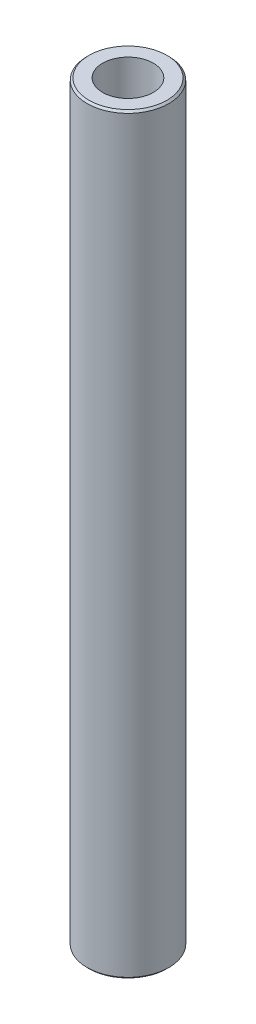
ISO-10303-21;
HEADER;
FILE_DESCRIPTION(('STEP AP214'),'2;1');
FILE_NAME('part.step','',(''),(''),'','','');
FILE_SCHEMA(('AUTOMOTIVE_DESIGN { 1 0 10303 214 1 1 1 1 }'));
ENDSEC;
DATA;
#1=APPLICATION_CONTEXT('core data for automotive mechanical design processes');
#2=APPLICATION_PROTOCOL_DEFINITION('international standard','automotive_design',2000,#1);
#3=PRODUCT_CONTEXT('',#1,'mechanical');
#4=PRODUCT('Part','Part','',(#3));
#5=PRODUCT_RELATED_PRODUCT_CATEGORY('part','',(#4));
#6=PRODUCT_DEFINITION_FORMATION('','',#4);
#7=PRODUCT_DEFINITION_CONTEXT('part definition',#1,'design');
#8=PRODUCT_DEFINITION('design','',#6,#7);
#9=PRODUCT_DEFINITION_SHAPE('','',#8);
#10=(LENGTH_UNIT() NAMED_UNIT(*) SI_UNIT(.MILLI.,.METRE.));
#11=(NAMED_UNIT(*) PLANE_ANGLE_UNIT() SI_UNIT($,.RADIAN.));
#12=(NAMED_UNIT(*) SI_UNIT($,.STERADIAN.) SOLID_ANGLE_UNIT());
#13=UNCERTAINTY_MEASURE_WITH_UNIT(LENGTH_MEASURE(1.E-05),#10,'distance_accuracy_value','');
#14=(GEOMETRIC_REPRESENTATION_CONTEXT(3) GLOBAL_UNCERTAINTY_ASSIGNED_CONTEXT((#13)) GLOBAL_UNIT_ASSIGNED_CONTEXT((#10,
#11,#12)) REPRESENTATION_CONTEXT('',''));
#15=CARTESIAN_POINT('',(0.,0.,0.));
#16=DIRECTION('',(0.,0.,1.));
#17=DIRECTION('',(1.,0.,0.));
#18=AXIS2_PLACEMENT_3D('',#15,#16,#17);
#19=CARTESIAN_POINT('',(0.,230.03489381087,0.));
#20=DIRECTION('',(0.,-1.,0.));
#21=DIRECTION('',(0.,0.,-1.));
#22=AXIS2_PLACEMENT_3D('',#19,#20,#21);
#23=CYLINDRICAL_SURFACE('',#22,12.5);
#24=CARTESIAN_POINT('',(0.,229.444508589191,0.));
#25=DIRECTION('',(0.,1.,0.));
#26=DIRECTION('',(0.,0.,1.));
#27=AXIS2_PLACEMENT_3D('',#24,#25,#26);
#28=CIRCLE('',#27,12.5);
#29=CARTESIAN_POINT('',(0.,229.444508589191,12.5));
#30=VERTEX_POINT('',#29);
#31=EDGE_CURVE('E50',#30,#30,#28,.F.);
#32=ORIENTED_EDGE('',*,*,#31,.T.);
#33=EDGE_LOOP('',(#32));
#34=FACE_BOUND('',#33,.T.);
#35=CARTESIAN_POINT('',(0.,0.590385221678202,0.));
#36=DIRECTION('',(0.,1.,0.));
#37=DIRECTION('',(0.,0.,1.));
#38=AXIS2_PLACEMENT_3D('',#35,#36,#37);
#39=CIRCLE('',#38,12.5);
#40=CARTESIAN_POINT('',(0.,0.590385221678202,12.5));
#41=VERTEX_POINT('',#40);
#42=EDGE_CURVE('E51',#41,#41,#39,.T.);
#43=ORIENTED_EDGE('',*,*,#42,.T.);
#44=EDGE_LOOP('',(#43));
#45=FACE_BOUND('',#44,.T.);
#46=ADVANCED_FACE('F39',(#34,#45),#23,.T.);
#47=CARTESIAN_POINT('',(0.,230.03489381087,0.));
#48=DIRECTION('',(0.,1.,0.));
#49=DIRECTION('',(0.,0.,1.));
#50=AXIS2_PLACEMENT_3D('',#47,#48,#49);
#51=PLANE('',#50);
#52=CARTESIAN_POINT('',(0.,230.03489381087,0.));
#53=DIRECTION('',(0.,1.,0.));
#54=DIRECTION('',(0.,0.,1.));
#55=AXIS2_PLACEMENT_3D('',#52,#53,#54);
#56=CIRCLE('',#55,11.9096147783219);
#57=CARTESIAN_POINT('',(0.,230.03489381087,11.9096147783219));
#58=VERTEX_POINT('',#57);
#59=EDGE_CURVE('E54',#58,#58,#56,.T.);
#60=ORIENTED_EDGE('',*,*,#59,.T.);
#61=EDGE_LOOP('',(#60));
#62=FACE_BOUND('',#61,.T.);
#63=CARTESIAN_POINT('',(0.,230.03489381087,0.));
#64=DIRECTION('',(0.,1.,0.));
#65=DIRECTION('',(0.,0.,1.));
#66=AXIS2_PLACEMENT_3D('',#63,#64,#65);
#67=CIRCLE('',#66,7.75933528406606);
#68=CARTESIAN_POINT('',(0.,230.03489381087,7.75933528406606));
#69=VERTEX_POINT('',#68);
#70=EDGE_CURVE('E58',#69,#69,#67,.T.);
#71=ORIENTED_EDGE('',*,*,#70,.F.);
#72=EDGE_LOOP('',(#71));
#73=FACE_BOUND('',#72,.T.);
#74=ADVANCED_FACE('F69',(#62,#73),#51,.T.);
#75=CARTESIAN_POINT('',(0.,0.,0.));
#76=DIRECTION('',(0.,1.,0.));
#77=DIRECTION('',(0.,0.,1.));
#78=AXIS2_PLACEMENT_3D('',#75,#76,#77);
#79=PLANE('',#78);
#80=CARTESIAN_POINT('',(0.,0.,0.));
#81=DIRECTION('',(0.,1.,0.));
#82=DIRECTION('',(0.,0.,1.));
#83=AXIS2_PLACEMENT_3D('',#80,#81,#82);
#84=CIRCLE('',#83,11.9096147783218);
#85=CARTESIAN_POINT('',(0.,0.,11.9096147783218));
#86=VERTEX_POINT('',#85);
#87=EDGE_CURVE('E10',#86,#86,#84,.F.);
#88=ORIENTED_EDGE('',*,*,#87,.T.);
#89=EDGE_LOOP('',(#88));
#90=FACE_BOUND('',#89,.T.);
#91=CARTESIAN_POINT('',(0.,0.,0.));
#92=DIRECTION('',(0.,1.,0.));
#93=DIRECTION('',(0.,0.,1.));
#94=AXIS2_PLACEMENT_3D('',#91,#92,#93);
#95=CIRCLE('',#94,7.75933528406606);
#96=CARTESIAN_POINT('',(0.,0.,7.75933528406606));
#97=VERTEX_POINT('',#96);
#98=EDGE_CURVE('E63',#97,#97,#95,.T.);
#99=ORIENTED_EDGE('',*,*,#98,.T.);
#100=EDGE_LOOP('',(#99));
#101=FACE_BOUND('',#100,.T.);
#102=ADVANCED_FACE('F75',(#90,#101),#79,.F.);
#103=CARTESIAN_POINT('',(0.,230.03489381087,0.));
#104=DIRECTION('',(0.,-1.,0.));
#105=DIRECTION('',(0.,0.,-1.));
#106=AXIS2_PLACEMENT_3D('',#103,#104,#105);
#107=CYLINDRICAL_SURFACE('',#106,7.75933528406606);
#108=ORIENTED_EDGE('',*,*,#70,.T.);
#109=EDGE_LOOP('',(#108));
#110=FACE_BOUND('',#109,.T.);
#111=ORIENTED_EDGE('',*,*,#98,.F.);
#112=EDGE_LOOP('',(#111));
#113=FACE_BOUND('',#112,.T.);
#114=ADVANCED_FACE('F70',(#110,#113),#107,.F.);
#115=CARTESIAN_POINT('',(0.,230.03489381087,0.));
#116=DIRECTION('',(0.,-1.,0.));
#117=DIRECTION('',(0.,0.,-1.));
#118=AXIS2_PLACEMENT_3D('',#115,#116,#117);
#119=CONICAL_SURFACE('',#118,11.9096147783219,0.785398163397463);
#120=ORIENTED_EDGE('',*,*,#31,.F.);
#121=EDGE_LOOP('',(#120));
#122=FACE_BOUND('',#121,.T.);
#123=ORIENTED_EDGE('',*,*,#59,.F.);
#124=EDGE_LOOP('',(#123));
#125=FACE_BOUND('',#124,.T.);
#126=ADVANCED_FACE('F81',(#122,#125),#119,.T.);
#127=CARTESIAN_POINT('',(0.,0.590385221678202,0.));
#128=DIRECTION('',(0.,1.,0.));
#129=DIRECTION('',(0.,0.,1.));
#130=AXIS2_PLACEMENT_3D('',#127,#128,#129);
#131=CONICAL_SURFACE('',#130,12.5,0.785398163397438);
#132=ORIENTED_EDGE('',*,*,#87,.F.);
#133=EDGE_LOOP('',(#132));
#134=FACE_BOUND('',#133,.T.);
#135=ORIENTED_EDGE('',*,*,#42,.F.);
#136=EDGE_LOOP('',(#135));
#137=FACE_BOUND('',#136,.T.);
#138=ADVANCED_FACE('F45',(#134,#137),#131,.T.);
#139=CLOSED_SHELL('',(#46,#74,#102,#114,#126,#138));
#140=MANIFOLD_SOLID_BREP('B2',#139);
#141=ADVANCED_BREP_SHAPE_REPRESENTATION('',(#18,#140),#14);
#142=SHAPE_DEFINITION_REPRESENTATION(#9,#141);
ENDSEC;
END-ISO-10303-21;
